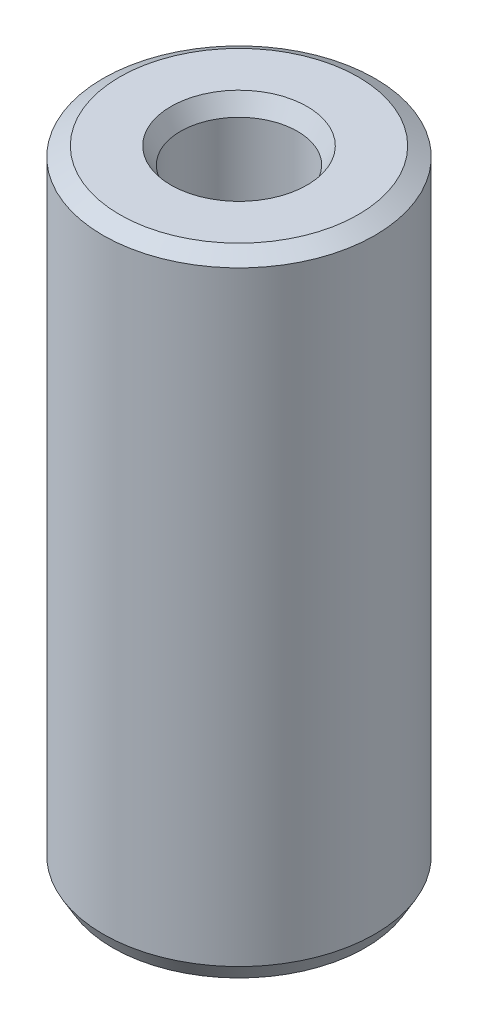
ISO-10303-21;
HEADER;
FILE_DESCRIPTION(('STEP AP214'),'2;1');
FILE_NAME('part.step','',(''),(''),'','','');
FILE_SCHEMA(('AUTOMOTIVE_DESIGN { 1 0 10303 214 1 1 1 1 }'));
ENDSEC;
DATA;
#1=APPLICATION_CONTEXT('core data for automotive mechanical design processes');
#2=APPLICATION_PROTOCOL_DEFINITION('international standard','automotive_design',2000,#1);
#3=PRODUCT_CONTEXT('',#1,'mechanical');
#4=PRODUCT('Part','Part','',(#3));
#5=PRODUCT_RELATED_PRODUCT_CATEGORY('part','',(#4));
#6=PRODUCT_DEFINITION_FORMATION('','',#4);
#7=PRODUCT_DEFINITION_CONTEXT('part definition',#1,'design');
#8=PRODUCT_DEFINITION('design','',#6,#7);
#9=PRODUCT_DEFINITION_SHAPE('','',#8);
#10=(LENGTH_UNIT() NAMED_UNIT(*) SI_UNIT(.MILLI.,.METRE.));
#11=(NAMED_UNIT(*) PLANE_ANGLE_UNIT() SI_UNIT($,.RADIAN.));
#12=(NAMED_UNIT(*) SI_UNIT($,.STERADIAN.) SOLID_ANGLE_UNIT());
#13=UNCERTAINTY_MEASURE_WITH_UNIT(LENGTH_MEASURE(1.E-05),#10,'distance_accuracy_value','');
#14=(GEOMETRIC_REPRESENTATION_CONTEXT(3) GLOBAL_UNCERTAINTY_ASSIGNED_CONTEXT((#13)) GLOBAL_UNIT_ASSIGNED_CONTEXT((#10,
#11,#12)) REPRESENTATION_CONTEXT('',''));
#15=CARTESIAN_POINT('',(0.,0.,0.));
#16=DIRECTION('',(0.,0.,1.));
#17=DIRECTION('',(1.,0.,0.));
#18=AXIS2_PLACEMENT_3D('',#15,#16,#17);
#19=CARTESIAN_POINT('',(0.,127.706571237737,0.));
#20=DIRECTION('',(0.,-1.,0.));
#21=DIRECTION('',(0.,0.,-1.));
#22=AXIS2_PLACEMENT_3D('',#19,#20,#21);
#23=CYLINDRICAL_SURFACE('',#22,27.5);
#24=CARTESIAN_POINT('',(0.,3.37249940623065,0.));
#25=DIRECTION('',(0.,1.,0.));
#26=DIRECTION('',(0.,0.,1.));
#27=AXIS2_PLACEMENT_3D('',#24,#25,#26);
#28=CIRCLE('',#27,27.5);
#29=CARTESIAN_POINT('',(0.,3.37249940623065,27.5));
#30=VERTEX_POINT('',#29);
#31=EDGE_CURVE('E10',#30,#30,#28,.T.);
#32=ORIENTED_EDGE('',*,*,#31,.T.);
#33=EDGE_LOOP('',(#32));
#34=FACE_BOUND('',#33,.T.);
#35=CARTESIAN_POINT('',(0.,125.759457797708,0.));
#36=DIRECTION('',(0.,1.,0.));
#37=DIRECTION('',(0.,0.,1.));
#38=AXIS2_PLACEMENT_3D('',#35,#36,#37);
#39=CIRCLE('',#38,27.5);
#40=CARTESIAN_POINT('',(0.,125.759457797708,27.5));
#41=VERTEX_POINT('',#40);
#42=EDGE_CURVE('E50',#41,#41,#39,.F.);
#43=ORIENTED_EDGE('',*,*,#42,.T.);
#44=EDGE_LOOP('',(#43));
#45=FACE_BOUND('',#44,.T.);
#46=ADVANCED_FACE('F39',(#34,#45),#23,.T.);
#47=CARTESIAN_POINT('',(0.,127.706571237737,0.));
#48=DIRECTION('',(0.,1.,0.));
#49=DIRECTION('',(0.,0.,1.));
#50=AXIS2_PLACEMENT_3D('',#47,#48,#49);
#51=PLANE('',#50);
#52=CARTESIAN_POINT('',(0.,127.706571237737,0.));
#53=DIRECTION('',(0.,1.,0.));
#54=DIRECTION('',(0.,0.,1.));
#55=AXIS2_PLACEMENT_3D('',#52,#53,#54);
#56=CIRCLE('',#55,13.7782798904357);
#57=CARTESIAN_POINT('',(0.,127.706571237737,13.7782798904357));
#58=VERTEX_POINT('',#57);
#59=EDGE_CURVE('E58',#58,#58,#56,.F.);
#60=ORIENTED_EDGE('',*,*,#59,.T.);
#61=EDGE_LOOP('',(#60));
#62=FACE_BOUND('',#61,.T.);
#63=CARTESIAN_POINT('',(0.,127.706571237737,0.));
#64=DIRECTION('',(0.,1.,0.));
#65=DIRECTION('',(0.,0.,1.));
#66=AXIS2_PLACEMENT_3D('',#63,#64,#65);
#67=CIRCLE('',#66,24.1275005937693);
#68=CARTESIAN_POINT('',(0.,127.706571237737,24.1275005937693));
#69=VERTEX_POINT('',#68);
#70=EDGE_CURVE('E61',#69,#69,#67,.T.);
#71=ORIENTED_EDGE('',*,*,#70,.T.);
#72=EDGE_LOOP('',(#71));
#73=FACE_BOUND('',#72,.T.);
#74=ADVANCED_FACE('F88',(#62,#73),#51,.T.);
#75=CARTESIAN_POINT('',(0.,0.,0.));
#76=DIRECTION('',(0.,1.,0.));
#77=DIRECTION('',(0.,0.,1.));
#78=AXIS2_PLACEMENT_3D('',#75,#76,#77);
#79=PLANE('',#78);
#80=CARTESIAN_POINT('',(0.,0.,0.));
#81=DIRECTION('',(0.,1.,0.));
#82=DIRECTION('',(0.,0.,1.));
#83=AXIS2_PLACEMENT_3D('',#80,#81,#82);
#84=CIRCLE('',#83,15.2036658566372);
#85=CARTESIAN_POINT('',(0.,0.,15.2036658566372));
#86=VERTEX_POINT('',#85);
#87=EDGE_CURVE('E51',#86,#86,#84,.T.);
#88=ORIENTED_EDGE('',*,*,#87,.T.);
#89=EDGE_LOOP('',(#88));
#90=FACE_BOUND('',#89,.T.);
#91=CARTESIAN_POINT('',(0.,0.,0.));
#92=DIRECTION('',(0.,1.,0.));
#93=DIRECTION('',(0.,0.,1.));
#94=AXIS2_PLACEMENT_3D('',#91,#92,#93);
#95=CIRCLE('',#94,25.5528865599709);
#96=CARTESIAN_POINT('',(0.,0.,25.5528865599709));
#97=VERTEX_POINT('',#96);
#98=EDGE_CURVE('E54',#97,#97,#95,.F.);
#99=ORIENTED_EDGE('',*,*,#98,.T.);
#100=EDGE_LOOP('',(#99));
#101=FACE_BOUND('',#100,.T.);
#102=ADVANCED_FACE('F83',(#90,#101),#79,.F.);
#103=CARTESIAN_POINT('',(0.,127.706571237737,0.));
#104=DIRECTION('',(0.,-1.,0.));
#105=DIRECTION('',(0.,0.,-1.));
#106=AXIS2_PLACEMENT_3D('',#103,#104,#105);
#107=CYLINDRICAL_SURFACE('',#106,11.8311664504065);
#108=CARTESIAN_POINT('',(0.,124.334071831506,0.));
#109=DIRECTION('',(0.,1.,0.));
#110=DIRECTION('',(0.,0.,1.));
#111=AXIS2_PLACEMENT_3D('',#108,#109,#110);
#112=CIRCLE('',#111,11.8311664504065);
#113=CARTESIAN_POINT('',(0.,124.334071831506,11.8311664504065));
#114=VERTEX_POINT('',#113);
#115=EDGE_CURVE('E67',#114,#114,#112,.T.);
#116=ORIENTED_EDGE('',*,*,#115,.T.);
#117=EDGE_LOOP('',(#116));
#118=FACE_BOUND('',#117,.T.);
#119=CARTESIAN_POINT('',(0.,1.94711344002912,0.));
#120=DIRECTION('',(0.,1.,0.));
#121=DIRECTION('',(0.,0.,1.));
#122=AXIS2_PLACEMENT_3D('',#119,#120,#121);
#123=CIRCLE('',#122,11.8311664504065);
#124=CARTESIAN_POINT('',(0.,1.94711344002912,11.8311664504065));
#125=VERTEX_POINT('',#124);
#126=EDGE_CURVE('E69',#125,#125,#123,.F.);
#127=ORIENTED_EDGE('',*,*,#126,.T.);
#128=EDGE_LOOP('',(#127));
#129=FACE_BOUND('',#128,.T.);
#130=ADVANCED_FACE('F71',(#118,#129),#107,.F.);
#131=CARTESIAN_POINT('',(0.,124.334071831506,0.));
#132=DIRECTION('',(0.,1.,0.));
#133=DIRECTION('',(0.,0.,1.));
#134=AXIS2_PLACEMENT_3D('',#131,#132,#133);
#135=CONICAL_SURFACE('',#134,11.8311664504065,0.523598775598299);
#136=ORIENTED_EDGE('',*,*,#59,.F.);
#137=EDGE_LOOP('',(#136));
#138=FACE_BOUND('',#137,.T.);
#139=ORIENTED_EDGE('',*,*,#115,.F.);
#140=EDGE_LOOP('',(#139));
#141=FACE_BOUND('',#140,.T.);
#142=ADVANCED_FACE('F77',(#138,#141),#135,.F.);
#143=CARTESIAN_POINT('',(0.,0.,0.));
#144=DIRECTION('',(0.,-1.,0.));
#145=DIRECTION('',(0.,0.,-1.));
#146=AXIS2_PLACEMENT_3D('',#143,#144,#145);
#147=CONICAL_SURFACE('',#146,15.2036658566372,1.04719755119659);
#148=ORIENTED_EDGE('',*,*,#126,.F.);
#149=EDGE_LOOP('',(#148));
#150=FACE_BOUND('',#149,.T.);
#151=ORIENTED_EDGE('',*,*,#87,.F.);
#152=EDGE_LOOP('',(#151));
#153=FACE_BOUND('',#152,.T.);
#154=ADVANCED_FACE('F73',(#150,#153),#147,.F.);
#155=CARTESIAN_POINT('',(0.,3.37249940623065,0.));
#156=DIRECTION('',(0.,1.,0.));
#157=DIRECTION('',(0.,0.,1.));
#158=AXIS2_PLACEMENT_3D('',#155,#156,#157);
#159=CONICAL_SURFACE('',#158,27.5,0.523598775598304);
#160=ORIENTED_EDGE('',*,*,#98,.F.);
#161=EDGE_LOOP('',(#160));
#162=FACE_BOUND('',#161,.T.);
#163=ORIENTED_EDGE('',*,*,#31,.F.);
#164=EDGE_LOOP('',(#163));
#165=FACE_BOUND('',#164,.T.);
#166=ADVANCED_FACE('F76',(#162,#165),#159,.T.);
#167=CARTESIAN_POINT('',(0.,127.706571237737,0.));
#168=DIRECTION('',(0.,-1.,0.));
#169=DIRECTION('',(0.,0.,-1.));
#170=AXIS2_PLACEMENT_3D('',#167,#168,#169);
#171=CONICAL_SURFACE('',#170,24.1275005937693,1.04719755119659);
#172=ORIENTED_EDGE('',*,*,#42,.F.);
#173=EDGE_LOOP('',(#172));
#174=FACE_BOUND('',#173,.T.);
#175=ORIENTED_EDGE('',*,*,#70,.F.);
#176=EDGE_LOOP('',(#175));
#177=FACE_BOUND('',#176,.T.);
#178=ADVANCED_FACE('F45',(#174,#177),#171,.T.);
#179=CLOSED_SHELL('',(#46,#74,#102,#130,#142,#154,#166,#178));
#180=MANIFOLD_SOLID_BREP('B2',#179);
#181=ADVANCED_BREP_SHAPE_REPRESENTATION('',(#18,#180),#14);
#182=SHAPE_DEFINITION_REPRESENTATION(#9,#181);
ENDSEC;
END-ISO-10303-21;
